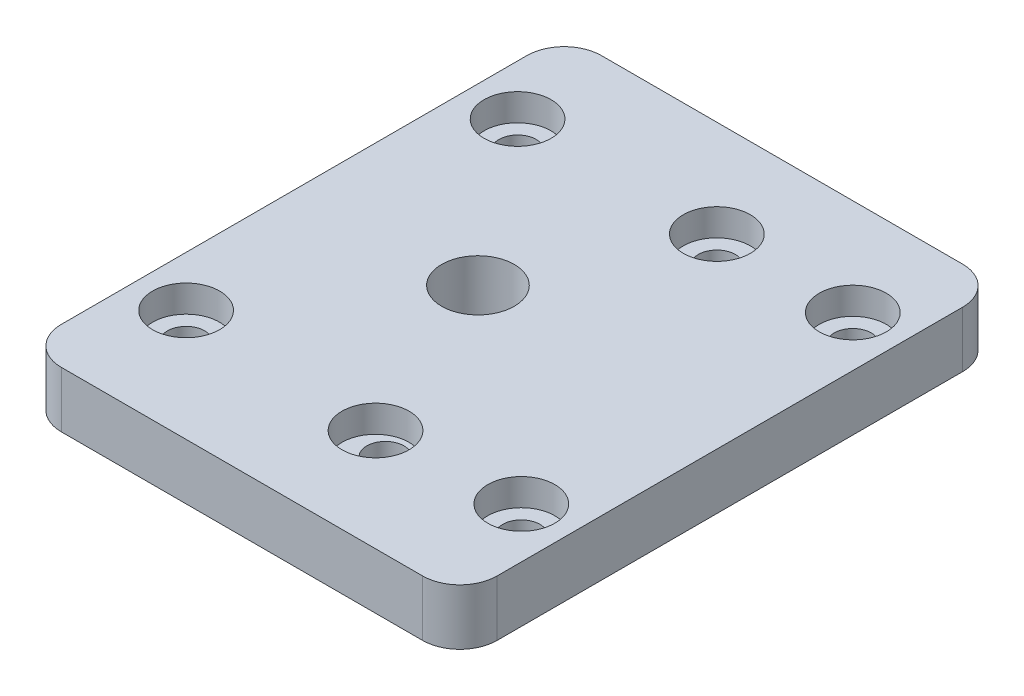
ISO-10303-21;
HEADER;
FILE_DESCRIPTION(('STEP AP214'),'2;1');
FILE_NAME('part.step','',(''),(''),'','','');
FILE_SCHEMA(('AUTOMOTIVE_DESIGN { 1 0 10303 214 1 1 1 1 }'));
ENDSEC;
DATA;
#1=APPLICATION_CONTEXT('core data for automotive mechanical design processes');
#2=APPLICATION_PROTOCOL_DEFINITION('international standard','automotive_design',2000,#1);
#3=PRODUCT_CONTEXT('',#1,'mechanical');
#4=PRODUCT('Part','Part','',(#3));
#5=PRODUCT_RELATED_PRODUCT_CATEGORY('part','',(#4));
#6=PRODUCT_DEFINITION_FORMATION('','',#4);
#7=PRODUCT_DEFINITION_CONTEXT('part definition',#1,'design');
#8=PRODUCT_DEFINITION('design','',#6,#7);
#9=PRODUCT_DEFINITION_SHAPE('','',#8);
#10=(LENGTH_UNIT() NAMED_UNIT(*) SI_UNIT(.MILLI.,.METRE.));
#11=(NAMED_UNIT(*) PLANE_ANGLE_UNIT() SI_UNIT($,.RADIAN.));
#12=(NAMED_UNIT(*) SI_UNIT($,.STERADIAN.) SOLID_ANGLE_UNIT());
#13=UNCERTAINTY_MEASURE_WITH_UNIT(LENGTH_MEASURE(1.E-05),#10,'distance_accuracy_value','');
#14=(GEOMETRIC_REPRESENTATION_CONTEXT(3) GLOBAL_UNCERTAINTY_ASSIGNED_CONTEXT((#13)) GLOBAL_UNIT_ASSIGNED_CONTEXT((#10,
#11,#12)) REPRESENTATION_CONTEXT('',''));
#15=CARTESIAN_POINT('',(0.,0.,0.));
#16=DIRECTION('',(0.,0.,1.));
#17=DIRECTION('',(1.,0.,0.));
#18=AXIS2_PLACEMENT_3D('',#15,#16,#17);
#19=CARTESIAN_POINT('',(-9.,-7.,-9.3));
#20=DIRECTION('',(0.,1.,0.));
#21=DIRECTION('',(0.,0.,1.));
#22=AXIS2_PLACEMENT_3D('',#19,#20,#21);
#23=CYLINDRICAL_SURFACE('',#22,1.);
#24=CARTESIAN_POINT('',(-9.,0.,-9.3));
#25=DIRECTION('',(0.,-1.,0.));
#26=DIRECTION('',(0.,0.,-1.));
#27=AXIS2_PLACEMENT_3D('',#24,#25,#26);
#28=CIRCLE('',#27,1.);
#29=CARTESIAN_POINT('',(-9.,0.,-10.3));
#30=VERTEX_POINT('',#29);
#31=EDGE_CURVE('E165',#30,#30,#28,.T.);
#32=ORIENTED_EDGE('',*,*,#31,.T.);
#33=EDGE_LOOP('',(#32));
#34=FACE_BOUND('',#33,.T.);
#35=CARTESIAN_POINT('',(-9.,1.55,-9.3));
#36=DIRECTION('',(0.,1.,0.));
#37=DIRECTION('',(0.,0.,1.));
#38=AXIS2_PLACEMENT_3D('',#35,#36,#37);
#39=CIRCLE('',#38,1.);
#40=CARTESIAN_POINT('',(-9.,1.55,-8.3));
#41=VERTEX_POINT('',#40);
#42=EDGE_CURVE('E36',#41,#41,#39,.F.);
#43=ORIENTED_EDGE('',*,*,#42,.F.);
#44=EDGE_LOOP('',(#43));
#45=FACE_BOUND('',#44,.T.);
#46=ADVANCED_FACE('F32',(#34,#45),#23,.F.);
#47=CARTESIAN_POINT('',(1.7,-7.,-9.3));
#48=DIRECTION('',(0.,1.,0.));
#49=DIRECTION('',(0.,0.,1.));
#50=AXIS2_PLACEMENT_3D('',#47,#48,#49);
#51=CYLINDRICAL_SURFACE('',#50,1.);
#52=CARTESIAN_POINT('',(1.7,0.,-9.3));
#53=DIRECTION('',(0.,-1.,0.));
#54=DIRECTION('',(0.,0.,-1.));
#55=AXIS2_PLACEMENT_3D('',#52,#53,#54);
#56=CIRCLE('',#55,1.);
#57=CARTESIAN_POINT('',(1.7,0.,-10.3));
#58=VERTEX_POINT('',#57);
#59=EDGE_CURVE('E161',#58,#58,#56,.T.);
#60=ORIENTED_EDGE('',*,*,#59,.T.);
#61=EDGE_LOOP('',(#60));
#62=FACE_BOUND('',#61,.T.);
#63=CARTESIAN_POINT('',(1.7,1.55,-9.3));
#64=DIRECTION('',(0.,1.,0.));
#65=DIRECTION('',(0.,0.,1.));
#66=AXIS2_PLACEMENT_3D('',#63,#64,#65);
#67=CIRCLE('',#66,1.);
#68=CARTESIAN_POINT('',(1.7,1.55,-8.3));
#69=VERTEX_POINT('',#68);
#70=EDGE_CURVE('E190',#69,#69,#67,.F.);
#71=ORIENTED_EDGE('',*,*,#70,.F.);
#72=EDGE_LOOP('',(#71));
#73=FACE_BOUND('',#72,.T.);
#74=ADVANCED_FACE('F269',(#62,#73),#51,.F.);
#75=CARTESIAN_POINT('',(9.,3.,-9.3));
#76=DIRECTION('',(0.,-1.,0.));
#77=DIRECTION('',(0.,0.,-1.));
#78=AXIS2_PLACEMENT_3D('',#75,#76,#77);
#79=CYLINDRICAL_SURFACE('',#78,1.);
#80=CARTESIAN_POINT('',(9.,0.,-9.3));
#81=DIRECTION('',(0.,1.,0.));
#82=DIRECTION('',(0.,0.,1.));
#83=AXIS2_PLACEMENT_3D('',#80,#81,#82);
#84=CIRCLE('',#83,1.);
#85=CARTESIAN_POINT('',(9.,0.,-8.3));
#86=VERTEX_POINT('',#85);
#87=EDGE_CURVE('E227',#86,#86,#84,.T.);
#88=ORIENTED_EDGE('',*,*,#87,.F.);
#89=EDGE_LOOP('',(#88));
#90=FACE_BOUND('',#89,.T.);
#91=CARTESIAN_POINT('',(9.,1.55,-9.3));
#92=DIRECTION('',(0.,1.,0.));
#93=DIRECTION('',(0.,0.,1.));
#94=AXIS2_PLACEMENT_3D('',#91,#92,#93);
#95=CIRCLE('',#94,1.);
#96=CARTESIAN_POINT('',(9.,1.55,-8.3));
#97=VERTEX_POINT('',#96);
#98=EDGE_CURVE('E186',#97,#97,#95,.T.);
#99=ORIENTED_EDGE('',*,*,#98,.T.);
#100=EDGE_LOOP('',(#99));
#101=FACE_BOUND('',#100,.T.);
#102=ADVANCED_FACE('F275',(#90,#101),#79,.F.);
#103=CARTESIAN_POINT('',(9.,3.,8.5));
#104=DIRECTION('',(0.,-1.,0.));
#105=DIRECTION('',(0.,0.,-1.));
#106=AXIS2_PLACEMENT_3D('',#103,#104,#105);
#107=CYLINDRICAL_SURFACE('',#106,1.);
#108=CARTESIAN_POINT('',(9.,0.,8.5));
#109=DIRECTION('',(0.,1.,0.));
#110=DIRECTION('',(0.,0.,-1.));
#111=AXIS2_PLACEMENT_3D('',#108,#109,#110);
#112=CIRCLE('',#111,1.);
#113=CARTESIAN_POINT('',(9.,0.,7.5));
#114=VERTEX_POINT('',#113);
#115=EDGE_CURVE('E133',#114,#114,#112,.T.);
#116=ORIENTED_EDGE('',*,*,#115,.F.);
#117=EDGE_LOOP('',(#116));
#118=FACE_BOUND('',#117,.T.);
#119=CARTESIAN_POINT('',(9.,1.55,8.5));
#120=DIRECTION('',(0.,1.,0.));
#121=DIRECTION('',(0.,0.,1.));
#122=AXIS2_PLACEMENT_3D('',#119,#120,#121);
#123=CIRCLE('',#122,1.);
#124=CARTESIAN_POINT('',(9.,1.55,9.5));
#125=VERTEX_POINT('',#124);
#126=EDGE_CURVE('E181',#125,#125,#123,.T.);
#127=ORIENTED_EDGE('',*,*,#126,.T.);
#128=EDGE_LOOP('',(#127));
#129=FACE_BOUND('',#128,.T.);
#130=ADVANCED_FACE('F285',(#118,#129),#107,.F.);
#131=CARTESIAN_POINT('',(1.7,3.,8.5));
#132=DIRECTION('',(0.,-1.,0.));
#133=DIRECTION('',(0.,0.,-1.));
#134=AXIS2_PLACEMENT_3D('',#131,#132,#133);
#135=CYLINDRICAL_SURFACE('',#134,1.);
#136=CARTESIAN_POINT('',(1.7,0.,8.5));
#137=DIRECTION('',(0.,1.,0.));
#138=DIRECTION('',(0.,0.,-1.));
#139=AXIS2_PLACEMENT_3D('',#136,#137,#138);
#140=CIRCLE('',#139,1.);
#141=CARTESIAN_POINT('',(1.7,0.,7.5));
#142=VERTEX_POINT('',#141);
#143=EDGE_CURVE('E164',#142,#142,#140,.T.);
#144=ORIENTED_EDGE('',*,*,#143,.F.);
#145=EDGE_LOOP('',(#144));
#146=FACE_BOUND('',#145,.T.);
#147=CARTESIAN_POINT('',(1.7,1.55,8.5));
#148=DIRECTION('',(0.,1.,0.));
#149=DIRECTION('',(0.,0.,1.));
#150=AXIS2_PLACEMENT_3D('',#147,#148,#149);
#151=CIRCLE('',#150,1.);
#152=CARTESIAN_POINT('',(1.7,1.55,9.5));
#153=VERTEX_POINT('',#152);
#154=EDGE_CURVE('E176',#153,#153,#151,.T.);
#155=ORIENTED_EDGE('',*,*,#154,.T.);
#156=EDGE_LOOP('',(#155));
#157=FACE_BOUND('',#156,.T.);
#158=ADVANCED_FACE('F281',(#146,#157),#135,.F.);
#159=CARTESIAN_POINT('',(-9.,3.,8.5));
#160=DIRECTION('',(0.,-1.,0.));
#161=DIRECTION('',(0.,0.,-1.));
#162=AXIS2_PLACEMENT_3D('',#159,#160,#161);
#163=CYLINDRICAL_SURFACE('',#162,1.);
#164=CARTESIAN_POINT('',(-9.,0.,8.5));
#165=DIRECTION('',(0.,1.,0.));
#166=DIRECTION('',(0.,0.,-1.));
#167=AXIS2_PLACEMENT_3D('',#164,#165,#166);
#168=CIRCLE('',#167,1.);
#169=CARTESIAN_POINT('',(-9.,0.,7.5));
#170=VERTEX_POINT('',#169);
#171=EDGE_CURVE('E230',#170,#170,#168,.T.);
#172=ORIENTED_EDGE('',*,*,#171,.F.);
#173=EDGE_LOOP('',(#172));
#174=FACE_BOUND('',#173,.T.);
#175=CARTESIAN_POINT('',(-9.,1.55,8.5));
#176=DIRECTION('',(0.,1.,0.));
#177=DIRECTION('',(0.,0.,1.));
#178=AXIS2_PLACEMENT_3D('',#175,#176,#177);
#179=CIRCLE('',#178,1.);
#180=CARTESIAN_POINT('',(-9.,1.55,9.5));
#181=VERTEX_POINT('',#180);
#182=EDGE_CURVE('E172',#181,#181,#179,.T.);
#183=ORIENTED_EDGE('',*,*,#182,.T.);
#184=EDGE_LOOP('',(#183));
#185=FACE_BOUND('',#184,.T.);
#186=ADVANCED_FACE('F284',(#174,#185),#163,.F.);
#187=CARTESIAN_POINT('',(0.,3.,0.));
#188=DIRECTION('',(0.,-1.,0.));
#189=DIRECTION('',(0.,0.,-1.));
#190=AXIS2_PLACEMENT_3D('',#187,#188,#189);
#191=PLANE('',#190);
#192=CARTESIAN_POINT('',(-9.,3.,-9.3));
#193=DIRECTION('',(0.,1.,0.));
#194=DIRECTION('',(0.,0.,1.));
#195=AXIS2_PLACEMENT_3D('',#192,#193,#194);
#196=CIRCLE('',#195,1.8);
#197=CARTESIAN_POINT('',(-9.,3.,-7.5));
#198=VERTEX_POINT('',#197);
#199=EDGE_CURVE('E206',#198,#198,#196,.T.);
#200=ORIENTED_EDGE('',*,*,#199,.F.);
#201=EDGE_LOOP('',(#200));
#202=FACE_BOUND('',#201,.T.);
#203=CARTESIAN_POINT('',(1.7,3.,-9.3));
#204=DIRECTION('',(0.,1.,0.));
#205=DIRECTION('',(0.,0.,1.));
#206=AXIS2_PLACEMENT_3D('',#203,#204,#205);
#207=CIRCLE('',#206,1.8);
#208=CARTESIAN_POINT('',(1.7,3.,-7.5));
#209=VERTEX_POINT('',#208);
#210=EDGE_CURVE('E199',#209,#209,#207,.T.);
#211=ORIENTED_EDGE('',*,*,#210,.F.);
#212=EDGE_LOOP('',(#211));
#213=FACE_BOUND('',#212,.T.);
#214=CARTESIAN_POINT('',(9.,3.,-9.3));
#215=DIRECTION('',(0.,1.,0.));
#216=DIRECTION('',(0.,0.,1.));
#217=AXIS2_PLACEMENT_3D('',#214,#215,#216);
#218=CIRCLE('',#217,1.8);
#219=CARTESIAN_POINT('',(9.,3.,-7.5));
#220=VERTEX_POINT('',#219);
#221=EDGE_CURVE('E192',#220,#220,#218,.T.);
#222=ORIENTED_EDGE('',*,*,#221,.F.);
#223=EDGE_LOOP('',(#222));
#224=FACE_BOUND('',#223,.T.);
#225=CARTESIAN_POINT('',(9.,3.,8.5));
#226=DIRECTION('',(0.,1.,0.));
#227=DIRECTION('',(0.,0.,1.));
#228=AXIS2_PLACEMENT_3D('',#225,#226,#227);
#229=CIRCLE('',#228,1.8);
#230=CARTESIAN_POINT('',(9.,3.,10.3));
#231=VERTEX_POINT('',#230);
#232=EDGE_CURVE('E188',#231,#231,#229,.T.);
#233=ORIENTED_EDGE('',*,*,#232,.F.);
#234=EDGE_LOOP('',(#233));
#235=FACE_BOUND('',#234,.T.);
#236=CARTESIAN_POINT('',(1.67182258337982,3.,9.00000000000064));
#237=DIRECTION('',(0.,1.,0.));
#238=DIRECTION('',(0.,0.,1.));
#239=AXIS2_PLACEMENT_3D('',#236,#237,#238);
#240=CIRCLE('',#239,1.8);
#241=CARTESIAN_POINT('',(1.67182258337982,3.,10.8000000000006));
#242=VERTEX_POINT('',#241);
#243=EDGE_CURVE('E184',#242,#242,#240,.T.);
#244=ORIENTED_EDGE('',*,*,#243,.F.);
#245=EDGE_LOOP('',(#244));
#246=FACE_BOUND('',#245,.T.);
#247=CARTESIAN_POINT('',(-9.,3.,8.5));
#248=DIRECTION('',(0.,1.,0.));
#249=DIRECTION('',(0.,0.,1.));
#250=AXIS2_PLACEMENT_3D('',#247,#248,#249);
#251=CIRCLE('',#250,1.8);
#252=CARTESIAN_POINT('',(-9.,3.,10.3));
#253=VERTEX_POINT('',#252);
#254=EDGE_CURVE('E179',#253,#253,#251,.T.);
#255=ORIENTED_EDGE('',*,*,#254,.F.);
#256=EDGE_LOOP('',(#255));
#257=FACE_BOUND('',#256,.T.);
#258=CARTESIAN_POINT('',(-2.3281774166205,3.,-0.499999999999999));
#259=DIRECTION('',(0.,1.,0.));
#260=DIRECTION('',(0.,0.,1.));
#261=AXIS2_PLACEMENT_3D('',#258,#259,#260);
#262=CIRCLE('',#261,1.95);
#263=CARTESIAN_POINT('',(-2.3281774166205,3.,1.45));
#264=VERTEX_POINT('',#263);
#265=EDGE_CURVE('E171',#264,#264,#262,.T.);
#266=ORIENTED_EDGE('',*,*,#265,.F.);
#267=EDGE_LOOP('',(#266));
#268=FACE_BOUND('',#267,.T.);
#269=DIRECTION('',(0.,0.,-1.));
#270=VECTOR('',#269,1.);
#271=CARTESIAN_POINT('',(11.7,3.,14.5));
#272=LINE('',#271,#270);
#273=CARTESIAN_POINT('',(11.7,3.,12.5));
#274=VERTEX_POINT('',#273);
#275=CARTESIAN_POINT('',(11.7,3.,-12.5));
#276=VERTEX_POINT('',#275);
#277=EDGE_CURVE('E138',#274,#276,#272,.T.);
#278=ORIENTED_EDGE('',*,*,#277,.T.);
#279=CARTESIAN_POINT('',(9.69999999999999,3.,-12.5));
#280=DIRECTION('',(0.,-1.,0.));
#281=DIRECTION('',(0.,0.,-1.));
#282=AXIS2_PLACEMENT_3D('',#279,#280,#281);
#283=CIRCLE('',#282,2.);
#284=CARTESIAN_POINT('',(9.69999999999999,3.,-14.5));
#285=VERTEX_POINT('',#284);
#286=EDGE_CURVE('E153',#276,#285,#283,.F.);
#287=ORIENTED_EDGE('',*,*,#286,.T.);
#288=DIRECTION('',(-1.,0.,0.));
#289=VECTOR('',#288,1.);
#290=CARTESIAN_POINT('',(-11.7,3.,-14.5));
#291=LINE('',#290,#289);
#292=CARTESIAN_POINT('',(-9.7,3.,-14.5));
#293=VERTEX_POINT('',#292);
#294=EDGE_CURVE('E120',#285,#293,#291,.T.);
#295=ORIENTED_EDGE('',*,*,#294,.T.);
#296=CARTESIAN_POINT('',(-9.7,3.,-12.5));
#297=DIRECTION('',(0.,-1.,0.));
#298=DIRECTION('',(0.,0.,-1.));
#299=AXIS2_PLACEMENT_3D('',#296,#297,#298);
#300=CIRCLE('',#299,2.);
#301=CARTESIAN_POINT('',(-11.7,3.,-12.5));
#302=VERTEX_POINT('',#301);
#303=EDGE_CURVE('E148',#293,#302,#300,.F.);
#304=ORIENTED_EDGE('',*,*,#303,.T.);
#305=DIRECTION('',(0.,0.,1.));
#306=VECTOR('',#305,1.);
#307=CARTESIAN_POINT('',(-11.7,3.,14.5));
#308=LINE('',#307,#306);
#309=CARTESIAN_POINT('',(-11.7,3.,12.5));
#310=VERTEX_POINT('',#309);
#311=EDGE_CURVE('E238',#302,#310,#308,.T.);
#312=ORIENTED_EDGE('',*,*,#311,.T.);
#313=CARTESIAN_POINT('',(-9.7,3.,12.5));
#314=DIRECTION('',(0.,-1.,0.));
#315=DIRECTION('',(0.,0.,-1.));
#316=AXIS2_PLACEMENT_3D('',#313,#314,#315);
#317=CIRCLE('',#316,2.);
#318=CARTESIAN_POINT('',(-9.7,3.,14.5));
#319=VERTEX_POINT('',#318);
#320=EDGE_CURVE('E56',#310,#319,#317,.F.);
#321=ORIENTED_EDGE('',*,*,#320,.T.);
#322=DIRECTION('',(1.,0.,0.));
#323=VECTOR('',#322,1.);
#324=CARTESIAN_POINT('',(-11.7,3.,14.5));
#325=LINE('',#324,#323);
#326=CARTESIAN_POINT('',(9.69999999999999,3.,14.5));
#327=VERTEX_POINT('',#326);
#328=EDGE_CURVE('E139',#319,#327,#325,.T.);
#329=ORIENTED_EDGE('',*,*,#328,.T.);
#330=CARTESIAN_POINT('',(9.7,3.,12.5));
#331=DIRECTION('',(0.,-1.,0.));
#332=DIRECTION('',(0.,0.,-1.));
#333=AXIS2_PLACEMENT_3D('',#330,#331,#332);
#334=CIRCLE('',#333,2.);
#335=EDGE_CURVE('E151',#327,#274,#334,.F.);
#336=ORIENTED_EDGE('',*,*,#335,.T.);
#337=EDGE_LOOP('',(#278,#287,#295,#304,#312,#321,#329,#336));
#338=FACE_BOUND('',#337,.T.);
#339=ADVANCED_FACE('F240',(#202,#213,#224,#235,#246,#257,#268,#338),#191,.F.);
#340=CARTESIAN_POINT('',(0.,0.,0.));
#341=DIRECTION('',(0.,-1.,0.));
#342=DIRECTION('',(0.,0.,-1.));
#343=AXIS2_PLACEMENT_3D('',#340,#341,#342);
#344=PLANE('',#343);
#345=CARTESIAN_POINT('',(-2.3281774166205,0.,-0.499999999999999));
#346=DIRECTION('',(0.,-1.,0.));
#347=DIRECTION('',(0.,0.,-1.));
#348=AXIS2_PLACEMENT_3D('',#345,#346,#347);
#349=CIRCLE('',#348,1.95);
#350=CARTESIAN_POINT('',(-2.3281774166205,0.,-2.45));
#351=VERTEX_POINT('',#350);
#352=EDGE_CURVE('E168',#351,#351,#349,.T.);
#353=ORIENTED_EDGE('',*,*,#352,.F.);
#354=EDGE_LOOP('',(#353));
#355=FACE_BOUND('',#354,.T.);
#356=ORIENTED_EDGE('',*,*,#31,.F.);
#357=EDGE_LOOP('',(#356));
#358=FACE_BOUND('',#357,.T.);
#359=ORIENTED_EDGE('',*,*,#59,.F.);
#360=EDGE_LOOP('',(#359));
#361=FACE_BOUND('',#360,.T.);
#362=ORIENTED_EDGE('',*,*,#87,.T.);
#363=EDGE_LOOP('',(#362));
#364=FACE_BOUND('',#363,.T.);
#365=ORIENTED_EDGE('',*,*,#115,.T.);
#366=EDGE_LOOP('',(#365));
#367=FACE_BOUND('',#366,.T.);
#368=DIRECTION('',(-1.,0.,0.));
#369=VECTOR('',#368,1.);
#370=CARTESIAN_POINT('',(-11.7,0.,-14.5));
#371=LINE('',#370,#369);
#372=CARTESIAN_POINT('',(9.69999999999999,0.,-14.5));
#373=VERTEX_POINT('',#372);
#374=CARTESIAN_POINT('',(-9.7,0.,-14.5));
#375=VERTEX_POINT('',#374);
#376=EDGE_CURVE('E117',#373,#375,#371,.T.);
#377=ORIENTED_EDGE('',*,*,#376,.F.);
#378=CARTESIAN_POINT('',(9.69999999999999,0.,-12.5));
#379=DIRECTION('',(0.,-1.,0.));
#380=DIRECTION('',(0.,0.,-1.));
#381=AXIS2_PLACEMENT_3D('',#378,#379,#380);
#382=CIRCLE('',#381,2.);
#383=CARTESIAN_POINT('',(11.7,0.,-12.5));
#384=VERTEX_POINT('',#383);
#385=EDGE_CURVE('E100',#373,#384,#382,.T.);
#386=ORIENTED_EDGE('',*,*,#385,.T.);
#387=DIRECTION('',(0.,0.,-1.));
#388=VECTOR('',#387,1.);
#389=CARTESIAN_POINT('',(11.7,0.,14.5));
#390=LINE('',#389,#388);
#391=CARTESIAN_POINT('',(11.7,0.,12.5));
#392=VERTEX_POINT('',#391);
#393=EDGE_CURVE('E128',#392,#384,#390,.T.);
#394=ORIENTED_EDGE('',*,*,#393,.F.);
#395=CARTESIAN_POINT('',(9.7,0.,12.5));
#396=DIRECTION('',(0.,-1.,0.));
#397=DIRECTION('',(0.,0.,-1.));
#398=AXIS2_PLACEMENT_3D('',#395,#396,#397);
#399=CIRCLE('',#398,2.);
#400=CARTESIAN_POINT('',(9.69999999999999,0.,14.5));
#401=VERTEX_POINT('',#400);
#402=EDGE_CURVE('E111',#392,#401,#399,.T.);
#403=ORIENTED_EDGE('',*,*,#402,.T.);
#404=DIRECTION('',(1.,0.,0.));
#405=VECTOR('',#404,1.);
#406=CARTESIAN_POINT('',(-11.7,0.,14.5));
#407=LINE('',#406,#405);
#408=CARTESIAN_POINT('',(-9.7,0.,14.5));
#409=VERTEX_POINT('',#408);
#410=EDGE_CURVE('E131',#409,#401,#407,.T.);
#411=ORIENTED_EDGE('',*,*,#410,.F.);
#412=CARTESIAN_POINT('',(-9.7,0.,12.5));
#413=DIRECTION('',(0.,-1.,0.));
#414=DIRECTION('',(0.,0.,-1.));
#415=AXIS2_PLACEMENT_3D('',#412,#413,#414);
#416=CIRCLE('',#415,2.);
#417=CARTESIAN_POINT('',(-11.7,0.,12.5));
#418=VERTEX_POINT('',#417);
#419=EDGE_CURVE('E142',#409,#418,#416,.T.);
#420=ORIENTED_EDGE('',*,*,#419,.T.);
#421=DIRECTION('',(0.,0.,1.));
#422=VECTOR('',#421,1.);
#423=CARTESIAN_POINT('',(-11.7,0.,14.5));
#424=LINE('',#423,#422);
#425=CARTESIAN_POINT('',(-11.7,0.,-12.5));
#426=VERTEX_POINT('',#425);
#427=EDGE_CURVE('E127',#426,#418,#424,.T.);
#428=ORIENTED_EDGE('',*,*,#427,.F.);
#429=CARTESIAN_POINT('',(-9.7,0.,-12.5));
#430=DIRECTION('',(0.,-1.,0.));
#431=DIRECTION('',(0.,0.,-1.));
#432=AXIS2_PLACEMENT_3D('',#429,#430,#431);
#433=CIRCLE('',#432,2.);
#434=EDGE_CURVE('E121',#426,#375,#433,.T.);
#435=ORIENTED_EDGE('',*,*,#434,.T.);
#436=EDGE_LOOP('',(#377,#386,#394,#403,#411,#420,#428,#435));
#437=FACE_BOUND('',#436,.T.);
#438=ORIENTED_EDGE('',*,*,#171,.T.);
#439=EDGE_LOOP('',(#438));
#440=FACE_BOUND('',#439,.T.);
#441=ORIENTED_EDGE('',*,*,#143,.T.);
#442=EDGE_LOOP('',(#441));
#443=FACE_BOUND('',#442,.T.);
#444=ADVANCED_FACE('F124',(#355,#358,#361,#364,#367,#437,#440,#443),#344,.T.);
#445=CARTESIAN_POINT('',(11.7,3.,14.5));
#446=DIRECTION('',(-1.,0.,0.));
#447=DIRECTION('',(0.,0.,1.));
#448=AXIS2_PLACEMENT_3D('',#445,#446,#447);
#449=PLANE('',#448);
#450=ORIENTED_EDGE('',*,*,#393,.T.);
#451=DIRECTION('',(0.,-1.,0.));
#452=VECTOR('',#451,1.);
#453=CARTESIAN_POINT('',(11.7,3.,-12.5));
#454=LINE('',#453,#452);
#455=EDGE_CURVE('E105',#384,#276,#454,.F.);
#456=ORIENTED_EDGE('',*,*,#455,.T.);
#457=ORIENTED_EDGE('',*,*,#277,.F.);
#458=DIRECTION('',(0.,-1.,0.));
#459=VECTOR('',#458,1.);
#460=CARTESIAN_POINT('',(11.7,3.,12.5));
#461=LINE('',#460,#459);
#462=EDGE_CURVE('E110',#274,#392,#461,.T.);
#463=ORIENTED_EDGE('',*,*,#462,.T.);
#464=EDGE_LOOP('',(#450,#456,#457,#463));
#465=FACE_BOUND('',#464,.T.);
#466=ADVANCED_FACE('F247',(#465),#449,.F.);
#467=CARTESIAN_POINT('',(-11.7,3.,-14.5));
#468=DIRECTION('',(0.,0.,1.));
#469=DIRECTION('',(1.,0.,0.));
#470=AXIS2_PLACEMENT_3D('',#467,#468,#469);
#471=PLANE('',#470);
#472=ORIENTED_EDGE('',*,*,#294,.F.);
#473=DIRECTION('',(0.,-1.,0.));
#474=VECTOR('',#473,1.);
#475=CARTESIAN_POINT('',(9.69999999999999,3.,-14.5));
#476=LINE('',#475,#474);
#477=EDGE_CURVE('E104',#285,#373,#476,.T.);
#478=ORIENTED_EDGE('',*,*,#477,.T.);
#479=ORIENTED_EDGE('',*,*,#376,.T.);
#480=DIRECTION('',(0.,-1.,0.));
#481=VECTOR('',#480,1.);
#482=CARTESIAN_POINT('',(-9.7,3.,-14.5));
#483=LINE('',#482,#481);
#484=EDGE_CURVE('E122',#375,#293,#483,.F.);
#485=ORIENTED_EDGE('',*,*,#484,.T.);
#486=EDGE_LOOP('',(#472,#478,#479,#485));
#487=FACE_BOUND('',#486,.T.);
#488=ADVANCED_FACE('F116',(#487),#471,.F.);
#489=CARTESIAN_POINT('',(-11.7,3.,14.5));
#490=DIRECTION('',(1.,0.,0.));
#491=DIRECTION('',(0.,0.,-1.));
#492=AXIS2_PLACEMENT_3D('',#489,#490,#491);
#493=PLANE('',#492);
#494=ORIENTED_EDGE('',*,*,#427,.T.);
#495=DIRECTION('',(0.,-1.,0.));
#496=VECTOR('',#495,1.);
#497=CARTESIAN_POINT('',(-11.7,3.,12.5));
#498=LINE('',#497,#496);
#499=EDGE_CURVE('E11',#418,#310,#498,.F.);
#500=ORIENTED_EDGE('',*,*,#499,.T.);
#501=ORIENTED_EDGE('',*,*,#311,.F.);
#502=DIRECTION('',(0.,-1.,0.));
#503=VECTOR('',#502,1.);
#504=CARTESIAN_POINT('',(-11.7,3.,-12.5));
#505=LINE('',#504,#503);
#506=EDGE_CURVE('E41',#302,#426,#505,.T.);
#507=ORIENTED_EDGE('',*,*,#506,.T.);
#508=EDGE_LOOP('',(#494,#500,#501,#507));
#509=FACE_BOUND('',#508,.T.);
#510=ADVANCED_FACE('F254',(#509),#493,.F.);
#511=CARTESIAN_POINT('',(-11.7,3.,14.5));
#512=DIRECTION('',(0.,0.,-1.));
#513=DIRECTION('',(-1.,0.,0.));
#514=AXIS2_PLACEMENT_3D('',#511,#512,#513);
#515=PLANE('',#514);
#516=ORIENTED_EDGE('',*,*,#410,.T.);
#517=DIRECTION('',(0.,-1.,0.));
#518=VECTOR('',#517,1.);
#519=CARTESIAN_POINT('',(9.69999999999999,3.,14.5));
#520=LINE('',#519,#518);
#521=EDGE_CURVE('E49',#401,#327,#520,.F.);
#522=ORIENTED_EDGE('',*,*,#521,.T.);
#523=ORIENTED_EDGE('',*,*,#328,.F.);
#524=DIRECTION('',(0.,-1.,0.));
#525=VECTOR('',#524,1.);
#526=CARTESIAN_POINT('',(-9.7,3.,14.5));
#527=LINE('',#526,#525);
#528=EDGE_CURVE('E155',#319,#409,#527,.T.);
#529=ORIENTED_EDGE('',*,*,#528,.T.);
#530=EDGE_LOOP('',(#516,#522,#523,#529));
#531=FACE_BOUND('',#530,.T.);
#532=ADVANCED_FACE('F249',(#531),#515,.F.);
#533=CARTESIAN_POINT('',(9.69999999999999,3.,-12.5));
#534=DIRECTION('',(0.,-1.,0.));
#535=DIRECTION('',(0.,0.,-1.));
#536=AXIS2_PLACEMENT_3D('',#533,#534,#535);
#537=CYLINDRICAL_SURFACE('',#536,2.);
#538=ORIENTED_EDGE('',*,*,#286,.F.);
#539=ORIENTED_EDGE('',*,*,#455,.F.);
#540=ORIENTED_EDGE('',*,*,#385,.F.);
#541=ORIENTED_EDGE('',*,*,#477,.F.);
#542=EDGE_LOOP('',(#538,#539,#540,#541));
#543=FACE_BOUND('',#542,.T.);
#544=ADVANCED_FACE('F103',(#543),#537,.T.);
#545=CARTESIAN_POINT('',(9.7,3.,12.5));
#546=DIRECTION('',(0.,-1.,0.));
#547=DIRECTION('',(0.,0.,-1.));
#548=AXIS2_PLACEMENT_3D('',#545,#546,#547);
#549=CYLINDRICAL_SURFACE('',#548,2.);
#550=ORIENTED_EDGE('',*,*,#335,.F.);
#551=ORIENTED_EDGE('',*,*,#521,.F.);
#552=ORIENTED_EDGE('',*,*,#402,.F.);
#553=ORIENTED_EDGE('',*,*,#462,.F.);
#554=EDGE_LOOP('',(#550,#551,#552,#553));
#555=FACE_BOUND('',#554,.T.);
#556=ADVANCED_FACE('F245',(#555),#549,.T.);
#557=CARTESIAN_POINT('',(-9.7,3.,12.5));
#558=DIRECTION('',(0.,-1.,0.));
#559=DIRECTION('',(0.,0.,-1.));
#560=AXIS2_PLACEMENT_3D('',#557,#558,#559);
#561=CYLINDRICAL_SURFACE('',#560,2.);
#562=ORIENTED_EDGE('',*,*,#320,.F.);
#563=ORIENTED_EDGE('',*,*,#499,.F.);
#564=ORIENTED_EDGE('',*,*,#419,.F.);
#565=ORIENTED_EDGE('',*,*,#528,.F.);
#566=EDGE_LOOP('',(#562,#563,#564,#565));
#567=FACE_BOUND('',#566,.T.);
#568=ADVANCED_FACE('F251',(#567),#561,.T.);
#569=CARTESIAN_POINT('',(-9.7,3.,-12.5));
#570=DIRECTION('',(0.,-1.,0.));
#571=DIRECTION('',(0.,0.,-1.));
#572=AXIS2_PLACEMENT_3D('',#569,#570,#571);
#573=CYLINDRICAL_SURFACE('',#572,2.);
#574=ORIENTED_EDGE('',*,*,#303,.F.);
#575=ORIENTED_EDGE('',*,*,#484,.F.);
#576=ORIENTED_EDGE('',*,*,#434,.F.);
#577=ORIENTED_EDGE('',*,*,#506,.F.);
#578=EDGE_LOOP('',(#574,#575,#576,#577));
#579=FACE_BOUND('',#578,.T.);
#580=ADVANCED_FACE('F34',(#579),#573,.T.);
#581=CARTESIAN_POINT('',(-2.3281774166205,-7.,-0.499999999999999));
#582=DIRECTION('',(0.,1.,0.));
#583=DIRECTION('',(0.,0.,1.));
#584=AXIS2_PLACEMENT_3D('',#581,#582,#583);
#585=CYLINDRICAL_SURFACE('',#584,1.95);
#586=ORIENTED_EDGE('',*,*,#352,.T.);
#587=EDGE_LOOP('',(#586));
#588=FACE_BOUND('',#587,.T.);
#589=ORIENTED_EDGE('',*,*,#265,.T.);
#590=EDGE_LOOP('',(#589));
#591=FACE_BOUND('',#590,.T.);
#592=ADVANCED_FACE('F260',(#588,#591),#585,.F.);
#593=CARTESIAN_POINT('',(-9.,1.55,8.5));
#594=DIRECTION('',(0.,1.,0.));
#595=DIRECTION('',(0.,0.,1.));
#596=AXIS2_PLACEMENT_3D('',#593,#594,#595);
#597=CYLINDRICAL_SURFACE('',#596,1.8);
#598=CARTESIAN_POINT('',(-9.,1.55,8.5));
#599=DIRECTION('',(0.,1.,0.));
#600=DIRECTION('',(0.,0.,1.));
#601=AXIS2_PLACEMENT_3D('',#598,#599,#600);
#602=CIRCLE('',#601,1.8);
#603=CARTESIAN_POINT('',(-9.,1.55,10.3));
#604=VERTEX_POINT('',#603);
#605=EDGE_CURVE('E175',#604,#604,#602,.T.);
#606=ORIENTED_EDGE('',*,*,#605,.F.);
#607=EDGE_LOOP('',(#606));
#608=FACE_BOUND('',#607,.T.);
#609=ORIENTED_EDGE('',*,*,#254,.T.);
#610=EDGE_LOOP('',(#609));
#611=FACE_BOUND('',#610,.T.);
#612=ADVANCED_FACE('F265',(#608,#611),#597,.F.);
#613=CARTESIAN_POINT('',(-9.,1.55,8.5));
#614=DIRECTION('',(0.,1.,0.));
#615=DIRECTION('',(0.,0.,1.));
#616=AXIS2_PLACEMENT_3D('',#613,#614,#615);
#617=PLANE('',#616);
#618=ORIENTED_EDGE('',*,*,#182,.F.);
#619=EDGE_LOOP('',(#618));
#620=FACE_BOUND('',#619,.T.);
#621=ORIENTED_EDGE('',*,*,#605,.T.);
#622=EDGE_LOOP('',(#621));
#623=FACE_BOUND('',#622,.T.);
#624=ADVANCED_FACE('F387',(#620,#623),#617,.T.);
#625=CARTESIAN_POINT('',(1.67182258337982,1.55,9.00000000000064));
#626=DIRECTION('',(0.,1.,0.));
#627=DIRECTION('',(0.,0.,1.));
#628=AXIS2_PLACEMENT_3D('',#625,#626,#627);
#629=CYLINDRICAL_SURFACE('',#628,1.8);
#630=CARTESIAN_POINT('',(1.67182258337982,1.55,9.00000000000064));
#631=DIRECTION('',(0.,1.,0.));
#632=DIRECTION('',(0.,0.,1.));
#633=AXIS2_PLACEMENT_3D('',#630,#631,#632);
#634=CIRCLE('',#633,1.8);
#635=CARTESIAN_POINT('',(1.67182258337982,1.55,10.8000000000006));
#636=VERTEX_POINT('',#635);
#637=EDGE_CURVE('E180',#636,#636,#634,.T.);
#638=ORIENTED_EDGE('',*,*,#637,.F.);
#639=EDGE_LOOP('',(#638));
#640=FACE_BOUND('',#639,.T.);
#641=ORIENTED_EDGE('',*,*,#243,.T.);
#642=EDGE_LOOP('',(#641));
#643=FACE_BOUND('',#642,.T.);
#644=ADVANCED_FACE('F396',(#640,#643),#629,.F.);
#645=CARTESIAN_POINT('',(1.67182258337982,1.55,9.00000000000064));
#646=DIRECTION('',(0.,1.,0.));
#647=DIRECTION('',(0.,0.,1.));
#648=AXIS2_PLACEMENT_3D('',#645,#646,#647);
#649=PLANE('',#648);
#650=ORIENTED_EDGE('',*,*,#154,.F.);
#651=EDGE_LOOP('',(#650));
#652=FACE_BOUND('',#651,.T.);
#653=ORIENTED_EDGE('',*,*,#637,.T.);
#654=EDGE_LOOP('',(#653));
#655=FACE_BOUND('',#654,.T.);
#656=ADVANCED_FACE('F406',(#652,#655),#649,.T.);
#657=CARTESIAN_POINT('',(9.,1.55,8.5));
#658=DIRECTION('',(0.,1.,0.));
#659=DIRECTION('',(0.,0.,1.));
#660=AXIS2_PLACEMENT_3D('',#657,#658,#659);
#661=CYLINDRICAL_SURFACE('',#660,1.8);
#662=CARTESIAN_POINT('',(9.,1.55,8.5));
#663=DIRECTION('',(0.,1.,0.));
#664=DIRECTION('',(0.,0.,1.));
#665=AXIS2_PLACEMENT_3D('',#662,#663,#664);
#666=CIRCLE('',#665,1.8);
#667=CARTESIAN_POINT('',(9.,1.55,10.3));
#668=VERTEX_POINT('',#667);
#669=EDGE_CURVE('E185',#668,#668,#666,.T.);
#670=ORIENTED_EDGE('',*,*,#669,.F.);
#671=EDGE_LOOP('',(#670));
#672=FACE_BOUND('',#671,.T.);
#673=ORIENTED_EDGE('',*,*,#232,.T.);
#674=EDGE_LOOP('',(#673));
#675=FACE_BOUND('',#674,.T.);
#676=ADVANCED_FACE('F416',(#672,#675),#661,.F.);
#677=CARTESIAN_POINT('',(9.,1.55,8.5));
#678=DIRECTION('',(0.,1.,0.));
#679=DIRECTION('',(0.,0.,1.));
#680=AXIS2_PLACEMENT_3D('',#677,#678,#679);
#681=PLANE('',#680);
#682=ORIENTED_EDGE('',*,*,#126,.F.);
#683=EDGE_LOOP('',(#682));
#684=FACE_BOUND('',#683,.T.);
#685=ORIENTED_EDGE('',*,*,#669,.T.);
#686=EDGE_LOOP('',(#685));
#687=FACE_BOUND('',#686,.T.);
#688=ADVANCED_FACE('F426',(#684,#687),#681,.T.);
#689=CARTESIAN_POINT('',(9.,1.55,-9.3));
#690=DIRECTION('',(0.,1.,0.));
#691=DIRECTION('',(0.,0.,1.));
#692=AXIS2_PLACEMENT_3D('',#689,#690,#691);
#693=CYLINDRICAL_SURFACE('',#692,1.8);
#694=CARTESIAN_POINT('',(9.,1.55,-9.3));
#695=DIRECTION('',(0.,1.,0.));
#696=DIRECTION('',(0.,0.,1.));
#697=AXIS2_PLACEMENT_3D('',#694,#695,#696);
#698=CIRCLE('',#697,1.8);
#699=CARTESIAN_POINT('',(9.,1.55,-7.5));
#700=VERTEX_POINT('',#699);
#701=EDGE_CURVE('E189',#700,#700,#698,.T.);
#702=ORIENTED_EDGE('',*,*,#701,.F.);
#703=EDGE_LOOP('',(#702));
#704=FACE_BOUND('',#703,.T.);
#705=ORIENTED_EDGE('',*,*,#221,.T.);
#706=EDGE_LOOP('',(#705));
#707=FACE_BOUND('',#706,.T.);
#708=ADVANCED_FACE('F436',(#704,#707),#693,.F.);
#709=CARTESIAN_POINT('',(9.,1.55,-9.3));
#710=DIRECTION('',(0.,1.,0.));
#711=DIRECTION('',(0.,0.,1.));
#712=AXIS2_PLACEMENT_3D('',#709,#710,#711);
#713=PLANE('',#712);
#714=ORIENTED_EDGE('',*,*,#98,.F.);
#715=EDGE_LOOP('',(#714));
#716=FACE_BOUND('',#715,.T.);
#717=ORIENTED_EDGE('',*,*,#701,.T.);
#718=EDGE_LOOP('',(#717));
#719=FACE_BOUND('',#718,.T.);
#720=ADVANCED_FACE('F446',(#716,#719),#713,.T.);
#721=CARTESIAN_POINT('',(1.7,1.55,-9.3));
#722=DIRECTION('',(0.,1.,0.));
#723=DIRECTION('',(0.,0.,1.));
#724=AXIS2_PLACEMENT_3D('',#721,#722,#723);
#725=PLANE('',#724);
#726=CARTESIAN_POINT('',(1.7,1.55,-9.3));
#727=DIRECTION('',(0.,1.,0.));
#728=DIRECTION('',(0.,0.,1.));
#729=AXIS2_PLACEMENT_3D('',#726,#727,#728);
#730=CIRCLE('',#729,1.8);
#731=CARTESIAN_POINT('',(1.7,1.55,-7.5));
#732=VERTEX_POINT('',#731);
#733=EDGE_CURVE('E193',#732,#732,#730,.T.);
#734=ORIENTED_EDGE('',*,*,#733,.T.);
#735=EDGE_LOOP('',(#734));
#736=FACE_BOUND('',#735,.T.);
#737=ORIENTED_EDGE('',*,*,#70,.T.);
#738=EDGE_LOOP('',(#737));
#739=FACE_BOUND('',#738,.T.);
#740=ADVANCED_FACE('F456',(#736,#739),#725,.T.);
#741=CARTESIAN_POINT('',(1.7,1.55,-9.3));
#742=DIRECTION('',(0.,1.,0.));
#743=DIRECTION('',(0.,0.,1.));
#744=AXIS2_PLACEMENT_3D('',#741,#742,#743);
#745=CYLINDRICAL_SURFACE('',#744,1.8);
#746=ORIENTED_EDGE('',*,*,#733,.F.);
#747=EDGE_LOOP('',(#746));
#748=FACE_BOUND('',#747,.T.);
#749=ORIENTED_EDGE('',*,*,#210,.T.);
#750=EDGE_LOOP('',(#749));
#751=FACE_BOUND('',#750,.T.);
#752=ADVANCED_FACE('F466',(#748,#751),#745,.F.);
#753=CARTESIAN_POINT('',(-9.,1.55,-9.3));
#754=DIRECTION('',(0.,1.,0.));
#755=DIRECTION('',(0.,0.,1.));
#756=AXIS2_PLACEMENT_3D('',#753,#754,#755);
#757=PLANE('',#756);
#758=CARTESIAN_POINT('',(-9.,1.55,-9.3));
#759=DIRECTION('',(0.,1.,0.));
#760=DIRECTION('',(0.,0.,1.));
#761=AXIS2_PLACEMENT_3D('',#758,#759,#760);
#762=CIRCLE('',#761,1.8);
#763=CARTESIAN_POINT('',(-9.,1.55,-7.5));
#764=VERTEX_POINT('',#763);
#765=EDGE_CURVE('E502',#764,#764,#762,.T.);
#766=ORIENTED_EDGE('',*,*,#765,.T.);
#767=EDGE_LOOP('',(#766));
#768=FACE_BOUND('',#767,.T.);
#769=ORIENTED_EDGE('',*,*,#42,.T.);
#770=EDGE_LOOP('',(#769));
#771=FACE_BOUND('',#770,.T.);
#772=ADVANCED_FACE('F475',(#768,#771),#757,.T.);
#773=CARTESIAN_POINT('',(-9.,1.55,-9.3));
#774=DIRECTION('',(0.,1.,0.));
#775=DIRECTION('',(0.,0.,1.));
#776=AXIS2_PLACEMENT_3D('',#773,#774,#775);
#777=CYLINDRICAL_SURFACE('',#776,1.8);
#778=ORIENTED_EDGE('',*,*,#765,.F.);
#779=EDGE_LOOP('',(#778));
#780=FACE_BOUND('',#779,.T.);
#781=ORIENTED_EDGE('',*,*,#199,.T.);
#782=EDGE_LOOP('',(#781));
#783=FACE_BOUND('',#782,.T.);
#784=ADVANCED_FACE('F485',(#780,#783),#777,.F.);
#785=CLOSED_SHELL('',(#46,#74,#102,#130,#158,#186,#339,#444,#466,#488,#510,#532,#544,#556,#568,
#580,#592,#612,#624,#644,#656,#676,#688,#708,#720,#740,#752,#772,#784));
#786=MANIFOLD_SOLID_BREP('B2',#785);
#787=ADVANCED_BREP_SHAPE_REPRESENTATION('',(#18,#786),#14);
#788=SHAPE_DEFINITION_REPRESENTATION(#9,#787);
ENDSEC;
END-ISO-10303-21;
